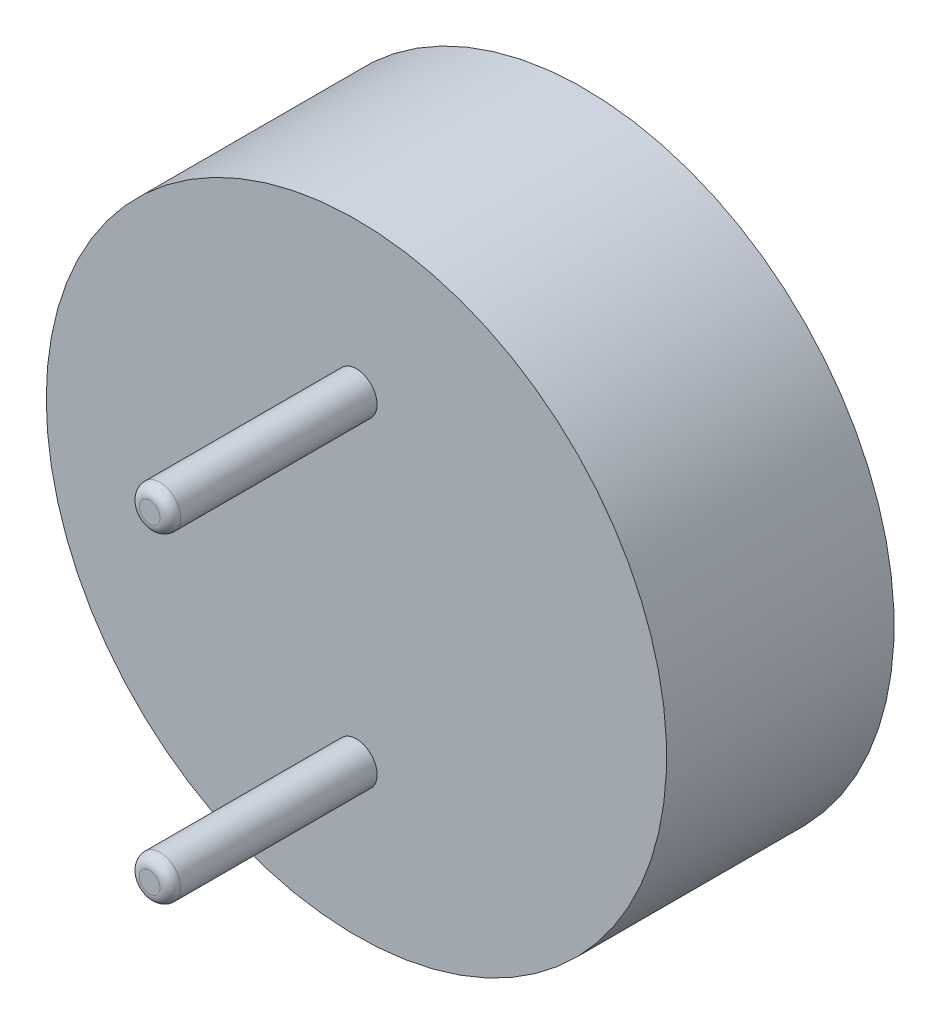
ISO-10303-21;
HEADER;
FILE_DESCRIPTION(('STEP AP214'),'2;1');
FILE_NAME('part.step','',(''),(''),'','','');
FILE_SCHEMA(('AUTOMOTIVE_DESIGN { 1 0 10303 214 1 1 1 1 }'));
ENDSEC;
DATA;
#1=APPLICATION_CONTEXT('core data for automotive mechanical design processes');
#2=APPLICATION_PROTOCOL_DEFINITION('international standard','automotive_design',2000,#1);
#3=PRODUCT_CONTEXT('',#1,'mechanical');
#4=PRODUCT('Part','Part','',(#3));
#5=PRODUCT_RELATED_PRODUCT_CATEGORY('part','',(#4));
#6=PRODUCT_DEFINITION_FORMATION('','',#4);
#7=PRODUCT_DEFINITION_CONTEXT('part definition',#1,'design');
#8=PRODUCT_DEFINITION('design','',#6,#7);
#9=PRODUCT_DEFINITION_SHAPE('','',#8);
#10=(LENGTH_UNIT() NAMED_UNIT(*) SI_UNIT(.MILLI.,.METRE.));
#11=(NAMED_UNIT(*) PLANE_ANGLE_UNIT() SI_UNIT($,.RADIAN.));
#12=(NAMED_UNIT(*) SI_UNIT($,.STERADIAN.) SOLID_ANGLE_UNIT());
#13=UNCERTAINTY_MEASURE_WITH_UNIT(LENGTH_MEASURE(1.E-05),#10,'distance_accuracy_value','');
#14=(GEOMETRIC_REPRESENTATION_CONTEXT(3) GLOBAL_UNCERTAINTY_ASSIGNED_CONTEXT((#13)) GLOBAL_UNIT_ASSIGNED_CONTEXT((#10,
#11,#12)) REPRESENTATION_CONTEXT('',''));
#15=CARTESIAN_POINT('',(0.,0.,0.));
#16=DIRECTION('',(0.,0.,1.));
#17=DIRECTION('',(1.,0.,0.));
#18=AXIS2_PLACEMENT_3D('',#15,#16,#17);
#19=CARTESIAN_POINT('',(0.,0.,-5.875));
#20=DIRECTION('',(0.,0.,1.));
#21=DIRECTION('',(1.,0.,0.));
#22=AXIS2_PLACEMENT_3D('',#19,#20,#21);
#23=PLANE('',#22);
#24=CARTESIAN_POINT('',(0.,0.,-5.875));
#25=DIRECTION('',(0.,0.,1.));
#26=DIRECTION('',(1.,0.,0.));
#27=AXIS2_PLACEMENT_3D('',#24,#25,#26);
#28=CIRCLE('',#27,8.26894374382339);
#29=CARTESIAN_POINT('',(8.26894374382339,0.,-5.875));
#30=VERTEX_POINT('',#29);
#31=EDGE_CURVE('E68',#30,#30,#28,.F.);
#32=ORIENTED_EDGE('',*,*,#31,.T.);
#33=EDGE_LOOP('',(#32));
#34=FACE_BOUND('',#33,.T.);
#35=ADVANCED_FACE('F33',(#34),#23,.F.);
#36=CARTESIAN_POINT('',(0.,0.,-5.125));
#37=DIRECTION('',(0.,0.,1.));
#38=DIRECTION('',(1.,0.,0.));
#39=AXIS2_PLACEMENT_3D('',#36,#37,#38);
#40=CONICAL_SURFACE('',#39,12.5,1.32581766366803);
#41=CARTESIAN_POINT('',(0.,0.,-5.57642500145332));
#42=DIRECTION('',(0.,0.,-1.));
#43=DIRECTION('',(-1.,0.,0.));
#44=AXIS2_PLACEMENT_3D('',#41,#42,#43);
#45=CIRCLE('',#44,10.6942999941867);
#46=CARTESIAN_POINT('',(-10.6942999941867,0.,-5.57642500145332));
#47=VERTEX_POINT('',#46);
#48=EDGE_CURVE('E62',#47,#47,#45,.F.);
#49=ORIENTED_EDGE('',*,*,#48,.T.);
#50=EDGE_LOOP('',(#49));
#51=FACE_BOUND('',#50,.T.);
#52=CARTESIAN_POINT('',(0.,0.,-5.42357499854668));
#53=DIRECTION('',(0.,0.,1.));
#54=DIRECTION('',(1.,0.,0.));
#55=AXIS2_PLACEMENT_3D('',#52,#53,#54);
#56=CIRCLE('',#55,11.3057000058133);
#57=CARTESIAN_POINT('',(11.3057000058133,0.,-5.42357499854668));
#58=VERTEX_POINT('',#57);
#59=EDGE_CURVE('E65',#58,#58,#56,.F.);
#60=ORIENTED_EDGE('',*,*,#59,.T.);
#61=EDGE_LOOP('',(#60));
#62=FACE_BOUND('',#61,.T.);
#63=ADVANCED_FACE('F99',(#51,#62),#40,.T.);
#64=CARTESIAN_POINT('',(15.,0.,-5.125));
#65=DIRECTION('',(0.,0.,1.));
#66=DIRECTION('',(1.,0.,0.));
#67=AXIS2_PLACEMENT_3D('',#64,#65,#66);
#68=PLANE('',#67);
#69=CARTESIAN_POINT('',(0.,0.,-5.125));
#70=DIRECTION('',(0.,0.,1.));
#71=DIRECTION('',(1.,0.,0.));
#72=AXIS2_PLACEMENT_3D('',#69,#70,#71);
#73=CIRCLE('',#72,13.7310562561766);
#74=CARTESIAN_POINT('',(13.7310562561766,0.,-5.125));
#75=VERTEX_POINT('',#74);
#76=EDGE_CURVE('E59',#75,#75,#73,.T.);
#77=ORIENTED_EDGE('',*,*,#76,.T.);
#78=EDGE_LOOP('',(#77));
#79=FACE_BOUND('',#78,.T.);
#80=CARTESIAN_POINT('',(0.,0.,-5.125));
#81=DIRECTION('',(0.,0.,-1.));
#82=DIRECTION('',(-1.,0.,0.));
#83=AXIS2_PLACEMENT_3D('',#80,#81,#82);
#84=CIRCLE('',#83,15.);
#85=CARTESIAN_POINT('',(-15.,0.,-5.125));
#86=VERTEX_POINT('',#85);
#87=EDGE_CURVE('E71',#86,#86,#84,.T.);
#88=ORIENTED_EDGE('',*,*,#87,.T.);
#89=EDGE_LOOP('',(#88));
#90=FACE_BOUND('',#89,.T.);
#91=ADVANCED_FACE('F92',(#79,#90),#68,.F.);
#92=CARTESIAN_POINT('',(0.,0.,0.));
#93=DIRECTION('',(0.,0.,-1.));
#94=DIRECTION('',(-1.,0.,0.));
#95=AXIS2_PLACEMENT_3D('',#92,#93,#94);
#96=CYLINDRICAL_SURFACE('',#95,15.);
#97=ORIENTED_EDGE('',*,*,#87,.F.);
#98=EDGE_LOOP('',(#97));
#99=FACE_BOUND('',#98,.T.);
#100=CARTESIAN_POINT('',(0.,0.,5.875));
#101=DIRECTION('',(0.,0.,-1.));
#102=DIRECTION('',(-1.,0.,0.));
#103=AXIS2_PLACEMENT_3D('',#100,#101,#102);
#104=CIRCLE('',#103,15.);
#105=CARTESIAN_POINT('',(-15.,0.,5.875));
#106=VERTEX_POINT('',#105);
#107=EDGE_CURVE('E74',#106,#106,#104,.T.);
#108=ORIENTED_EDGE('',*,*,#107,.T.);
#109=EDGE_LOOP('',(#108));
#110=FACE_BOUND('',#109,.T.);
#111=ADVANCED_FACE('F78',(#99,#110),#96,.T.);
#112=CARTESIAN_POINT('',(0.,0.,5.875));
#113=DIRECTION('',(0.,0.,-1.));
#114=DIRECTION('',(-1.,0.,0.));
#115=AXIS2_PLACEMENT_3D('',#112,#113,#114);
#116=PLANE('',#115);
#117=CARTESIAN_POINT('',(0.,-7.75,5.875));
#118=DIRECTION('',(0.,0.,-1.));
#119=DIRECTION('',(-1.,0.,0.));
#120=AXIS2_PLACEMENT_3D('',#117,#118,#119);
#121=CIRCLE('',#120,1.);
#122=CARTESIAN_POINT('',(-0.999999999999998,-7.75,5.875));
#123=VERTEX_POINT('',#122);
#124=EDGE_CURVE('E53',#123,#123,#121,.F.);
#125=ORIENTED_EDGE('',*,*,#124,.F.);
#126=EDGE_LOOP('',(#125));
#127=FACE_BOUND('',#126,.T.);
#128=CARTESIAN_POINT('',(0.,7.75,5.875));
#129=DIRECTION('',(0.,0.,-1.));
#130=DIRECTION('',(-1.,0.,0.));
#131=AXIS2_PLACEMENT_3D('',#128,#129,#130);
#132=CIRCLE('',#131,1.);
#133=CARTESIAN_POINT('',(-1.,7.75,5.875));
#134=VERTEX_POINT('',#133);
#135=EDGE_CURVE('E56',#134,#134,#132,.F.);
#136=ORIENTED_EDGE('',*,*,#135,.F.);
#137=EDGE_LOOP('',(#136));
#138=FACE_BOUND('',#137,.T.);
#139=ORIENTED_EDGE('',*,*,#107,.F.);
#140=EDGE_LOOP('',(#139));
#141=FACE_BOUND('',#140,.T.);
#142=ADVANCED_FACE('F80',(#127,#138,#141),#116,.F.);
#143=CARTESIAN_POINT('',(0.,0.,4.125));
#144=DIRECTION('',(0.,0.,1.));
#145=DIRECTION('',(1.,0.,0.));
#146=AXIS2_PLACEMENT_3D('',#143,#144,#145);
#147=DEGENERATE_TOROIDAL_SURFACE('',#146,8.26894374382339,10.,.T.);
#148=ORIENTED_EDGE('',*,*,#48,.F.);
#149=EDGE_LOOP('',(#148));
#150=FACE_BOUND('',#149,.T.);
#151=ORIENTED_EDGE('',*,*,#31,.F.);
#152=EDGE_LOOP('',(#151));
#153=FACE_BOUND('',#152,.T.);
#154=ADVANCED_FACE('F82',(#150,#153),#147,.T.);
#155=CARTESIAN_POINT('',(0.,0.,-15.125));
#156=DIRECTION('',(0.,0.,1.));
#157=DIRECTION('',(1.,0.,0.));
#158=AXIS2_PLACEMENT_3D('',#155,#156,#157);
#159=TOROIDAL_SURFACE('',#158,13.7310562561766,10.);
#160=ORIENTED_EDGE('',*,*,#76,.F.);
#161=EDGE_LOOP('',(#160));
#162=FACE_BOUND('',#161,.T.);
#163=ORIENTED_EDGE('',*,*,#59,.F.);
#164=EDGE_LOOP('',(#163));
#165=FACE_BOUND('',#164,.T.);
#166=ADVANCED_FACE('F89',(#162,#165),#159,.F.);
#167=CARTESIAN_POINT('',(0.,7.75,15.875));
#168=DIRECTION('',(0.,0.,-1.));
#169=DIRECTION('',(-1.,0.,0.));
#170=AXIS2_PLACEMENT_3D('',#167,#168,#169);
#171=CYLINDRICAL_SURFACE('',#170,1.);
#172=CARTESIAN_POINT('',(0.,7.75,15.375));
#173=DIRECTION('',(0.,0.,1.));
#174=DIRECTION('',(1.,0.,0.));
#175=AXIS2_PLACEMENT_3D('',#172,#173,#174);
#176=CIRCLE('',#175,1.);
#177=CARTESIAN_POINT('',(1.,7.75,15.375));
#178=VERTEX_POINT('',#177);
#179=EDGE_CURVE('E44',#178,#178,#176,.F.);
#180=ORIENTED_EDGE('',*,*,#179,.T.);
#181=EDGE_LOOP('',(#180));
#182=FACE_BOUND('',#181,.T.);
#183=ORIENTED_EDGE('',*,*,#135,.T.);
#184=EDGE_LOOP('',(#183));
#185=FACE_BOUND('',#184,.T.);
#186=ADVANCED_FACE('F110',(#182,#185),#171,.T.);
#187=CARTESIAN_POINT('',(0.,7.75,15.875));
#188=DIRECTION('',(0.,0.,1.));
#189=DIRECTION('',(1.,0.,0.));
#190=AXIS2_PLACEMENT_3D('',#187,#188,#189);
#191=PLANE('',#190);
#192=CARTESIAN_POINT('',(0.,7.75,15.875));
#193=DIRECTION('',(0.,0.,1.));
#194=DIRECTION('',(1.,0.,0.));
#195=AXIS2_PLACEMENT_3D('',#192,#193,#194);
#196=CIRCLE('',#195,0.5);
#197=CARTESIAN_POINT('',(0.500000000000001,7.75,15.875));
#198=VERTEX_POINT('',#197);
#199=EDGE_CURVE('E48',#198,#198,#196,.T.);
#200=ORIENTED_EDGE('',*,*,#199,.T.);
#201=EDGE_LOOP('',(#200));
#202=FACE_BOUND('',#201,.T.);
#203=ADVANCED_FACE('F127',(#202),#191,.T.);
#204=CARTESIAN_POINT('',(0.,-7.75,15.875));
#205=DIRECTION('',(0.,0.,-1.));
#206=DIRECTION('',(-1.,0.,0.));
#207=AXIS2_PLACEMENT_3D('',#204,#205,#206);
#208=CYLINDRICAL_SURFACE('',#207,1.);
#209=CARTESIAN_POINT('',(0.,-7.75,15.375));
#210=DIRECTION('',(0.,0.,1.));
#211=DIRECTION('',(1.,0.,0.));
#212=AXIS2_PLACEMENT_3D('',#209,#210,#211);
#213=CIRCLE('',#212,1.);
#214=CARTESIAN_POINT('',(1.,-7.75,15.375));
#215=VERTEX_POINT('',#214);
#216=EDGE_CURVE('E10',#215,#215,#213,.F.);
#217=ORIENTED_EDGE('',*,*,#216,.T.);
#218=EDGE_LOOP('',(#217));
#219=FACE_BOUND('',#218,.T.);
#220=ORIENTED_EDGE('',*,*,#124,.T.);
#221=EDGE_LOOP('',(#220));
#222=FACE_BOUND('',#221,.T.);
#223=ADVANCED_FACE('F121',(#219,#222),#208,.T.);
#224=CARTESIAN_POINT('',(0.,-7.75,15.875));
#225=DIRECTION('',(0.,0.,1.));
#226=DIRECTION('',(1.,0.,0.));
#227=AXIS2_PLACEMENT_3D('',#224,#225,#226);
#228=PLANE('',#227);
#229=CARTESIAN_POINT('',(0.,-7.75,15.875));
#230=DIRECTION('',(0.,0.,1.));
#231=DIRECTION('',(1.,0.,0.));
#232=AXIS2_PLACEMENT_3D('',#229,#230,#231);
#233=CIRCLE('',#232,0.5);
#234=CARTESIAN_POINT('',(0.500000000000002,-7.75,15.875));
#235=VERTEX_POINT('',#234);
#236=EDGE_CURVE('E40',#235,#235,#233,.T.);
#237=ORIENTED_EDGE('',*,*,#236,.T.);
#238=EDGE_LOOP('',(#237));
#239=FACE_BOUND('',#238,.T.);
#240=ADVANCED_FACE('F114',(#239),#228,.T.);
#241=CARTESIAN_POINT('',(0.,7.75,15.375));
#242=DIRECTION('',(0.,0.,1.));
#243=DIRECTION('',(1.,0.,0.));
#244=AXIS2_PLACEMENT_3D('',#241,#242,#243);
#245=TOROIDAL_SURFACE('',#244,0.5,0.5);
#246=ORIENTED_EDGE('',*,*,#179,.F.);
#247=EDGE_LOOP('',(#246));
#248=FACE_BOUND('',#247,.T.);
#249=ORIENTED_EDGE('',*,*,#199,.F.);
#250=EDGE_LOOP('',(#249));
#251=FACE_BOUND('',#250,.T.);
#252=ADVANCED_FACE('F112',(#248,#251),#245,.T.);
#253=CARTESIAN_POINT('',(0.,-7.75,15.375));
#254=DIRECTION('',(0.,0.,1.));
#255=DIRECTION('',(1.,0.,0.));
#256=AXIS2_PLACEMENT_3D('',#253,#254,#255);
#257=DEGENERATE_TOROIDAL_SURFACE('',#256,0.5,0.5,.T.);
#258=ORIENTED_EDGE('',*,*,#216,.F.);
#259=EDGE_LOOP('',(#258));
#260=FACE_BOUND('',#259,.T.);
#261=ORIENTED_EDGE('',*,*,#236,.F.);
#262=EDGE_LOOP('',(#261));
#263=FACE_BOUND('',#262,.T.);
#264=ADVANCED_FACE('F35',(#260,#263),#257,.T.);
#265=CLOSED_SHELL('',(#35,#63,#91,#111,#142,#154,#166,#186,#203,#223,#240,#252,#264));
#266=MANIFOLD_SOLID_BREP('B2',#265);
#267=ADVANCED_BREP_SHAPE_REPRESENTATION('',(#18,#266),#14);
#268=SHAPE_DEFINITION_REPRESENTATION(#9,#267);
ENDSEC;
END-ISO-10303-21;
